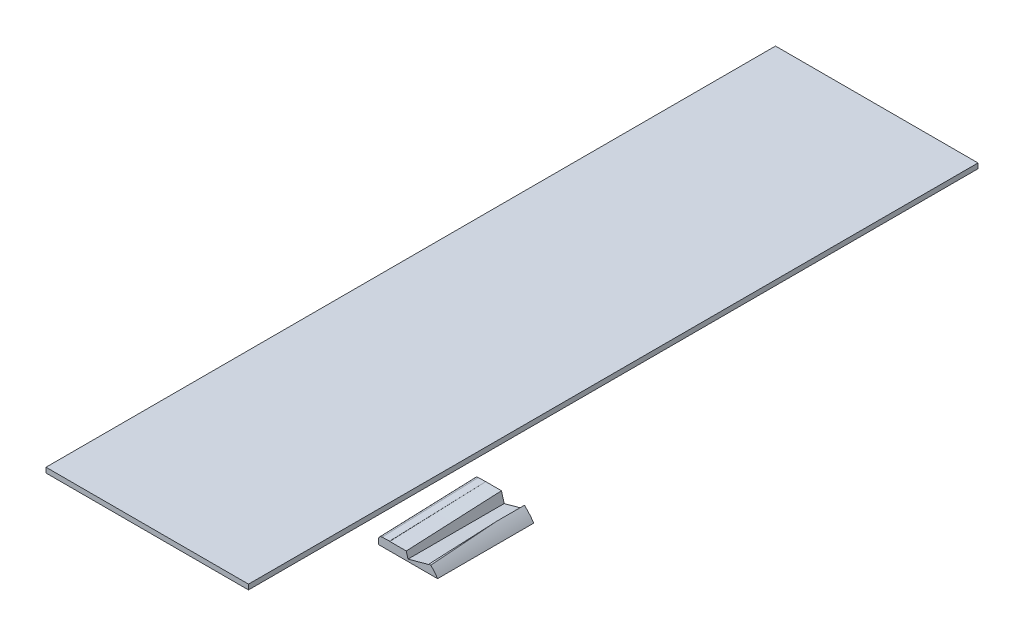
ISO-10303-21;
HEADER;
FILE_DESCRIPTION(('STEP AP214'),'2;1');
FILE_NAME('part.step','',(''),(''),'','','');
FILE_SCHEMA(('AUTOMOTIVE_DESIGN { 1 0 10303 214 1 1 1 1 }'));
ENDSEC;
DATA;
#1=APPLICATION_CONTEXT('core data for automotive mechanical design processes');
#2=APPLICATION_PROTOCOL_DEFINITION('international standard','automotive_design',2000,#1);
#3=PRODUCT_CONTEXT('',#1,'mechanical');
#4=PRODUCT('Part','Part','',(#3));
#5=PRODUCT_RELATED_PRODUCT_CATEGORY('part','',(#4));
#6=PRODUCT_DEFINITION_FORMATION('','',#4);
#7=PRODUCT_DEFINITION_CONTEXT('part definition',#1,'design');
#8=PRODUCT_DEFINITION('design','',#6,#7);
#9=PRODUCT_DEFINITION_SHAPE('','',#8);
#10=(LENGTH_UNIT() NAMED_UNIT(*) SI_UNIT(.MILLI.,.METRE.));
#11=(NAMED_UNIT(*) PLANE_ANGLE_UNIT() SI_UNIT($,.RADIAN.));
#12=(NAMED_UNIT(*) SI_UNIT($,.STERADIAN.) SOLID_ANGLE_UNIT());
#13=UNCERTAINTY_MEASURE_WITH_UNIT(LENGTH_MEASURE(1.E-05),#10,'distance_accuracy_value','');
#14=(GEOMETRIC_REPRESENTATION_CONTEXT(3) GLOBAL_UNCERTAINTY_ASSIGNED_CONTEXT((#13)) GLOBAL_UNIT_ASSIGNED_CONTEXT((#10,
#11,#12)) REPRESENTATION_CONTEXT('',''));
#15=CARTESIAN_POINT('',(0.,0.,0.));
#16=DIRECTION('',(0.,0.,1.));
#17=DIRECTION('',(1.,0.,0.));
#18=AXIS2_PLACEMENT_3D('',#15,#16,#17);
#19=CARTESIAN_POINT('',(38.8064860248671,394.0012038353,482.120102696812));
#20=DIRECTION('',(0.964308162620724,0.2647824909299,0.));
#21=DIRECTION('',(-0.2647824909299,0.964308162620724,0.));
#22=AXIS2_PLACEMENT_3D('',#19,#20,#21);
#23=PLANE('',#22);
#24=DIRECTION('',(0.,0.,1.));
#25=VECTOR('',#24,1.);
#26=CARTESIAN_POINT('',(116.345470624094,111.612910305147,-50.4145633031884));
#27=LINE('',#26,#25);
#28=CARTESIAN_POINT('',(116.345470624094,111.612910305147,124.093212790419));
#29=VERTEX_POINT('',#28);
#30=CARTESIAN_POINT('',(116.345470624094,111.612910305147,314.093212790419));
#31=VERTEX_POINT('',#30);
#32=EDGE_CURVE('E566',#29,#31,#27,.T.);
#33=ORIENTED_EDGE('',*,*,#32,.F.);
#34=DIRECTION('',(-0.2647824909299,0.964308162620724,0.));
#35=VECTOR('',#34,1.);
#36=CARTESIAN_POINT('',(38.8064860248671,394.0012038353,124.093212790419));
#37=LINE('',#36,#35);
#38=CARTESIAN_POINT('',(111.032147749001,130.96343684902,124.093212790419));
#39=VERTEX_POINT('',#38);
#40=EDGE_CURVE('E489',#29,#39,#37,.T.);
#41=ORIENTED_EDGE('',*,*,#40,.T.);
#42=CARTESIAN_POINT('',(109.753405284803,135.620473618277,-5.23468981717832));
#43=CARTESIAN_POINT('',(109.859389161119,135.234492216415,6.36334958936649));
#44=CARTESIAN_POINT('',(109.968473912636,134.837217774529,17.960976204007));
#45=CARTESIAN_POINT('',(110.191608713052,134.024585834063,41.1555083415589));
#46=CARTESIAN_POINT('',(110.305658744404,133.609228399388,52.7524138668736));
#47=CARTESIAN_POINT('',(110.5374882961,132.764931149021,75.9456780913623));
#48=CARTESIAN_POINT('',(110.655267812523,132.33599134761,87.5420367910984));
#49=CARTESIAN_POINT('',(110.893324143082,131.469016866347,110.734387183022));
#50=CARTESIAN_POINT('',(111.013600957132,131.030982186808,122.330378875221));
#51=CARTESIAN_POINT('',(111.255420185839,130.150303652129,145.522173363155));
#52=CARTESIAN_POINT('',(111.376962600501,129.707659796972,157.11797615889));
#53=CARTESIAN_POINT('',(111.620080541348,128.822251498203,180.309571512638));
#54=CARTESIAN_POINT('',(111.741656067517,128.379487054646,191.905364070655));
#55=CARTESIAN_POINT('',(111.983605853896,127.498333043556,215.097182801119));
#56=CARTESIAN_POINT('',(112.103980108491,127.059943496468,226.693208974403));
#57=CARTESIAN_POINT('',(112.342287225985,126.19205567729,249.885598553668));
#58=CARTESIAN_POINT('',(112.460220093464,125.762557388518,261.481961958975));
#59=CARTESIAN_POINT('',(112.692399143381,124.916987304792,284.675195414121));
#60=CARTESIAN_POINT('',(112.806645332728,124.500915484678,296.27206546297));
#61=CARTESIAN_POINT('',(113.030197847382,123.686762275762,319.466482028005));
#62=CARTESIAN_POINT('',(113.139504174712,123.288680879593,331.064028543912));
#63=CARTESIAN_POINT('',(113.351915343806,122.515103202801,354.259971588434));
#64=CARTESIAN_POINT('',(113.455020166764,122.139606990664,365.858368119519));
#65=CARTESIAN_POINT('',(113.653752060195,121.415847703049,389.056177246248));
#66=CARTESIAN_POINT('',(113.749379063485,121.067584872239,400.655589850082));
#67=CARTESIAN_POINT('',(113.840628259898,120.735265523539,412.255506908933));
#68=B_SPLINE_CURVE_WITH_KNOTS('',3,(#42,#43,#44,#45,#46,#47,#48,#49,#50,#51,#52,#53,#54,#55,#56,
#57,#58,#59,#60,#61,#62,#63,#64,#65,#66,#67),.UNSPECIFIED.,.F.,.F.,(4,2,2,2,2,2,2,2,2,2,2,2,4),
(0.,34.8148147103214,69.6295063951828,104.44416147604,139.25881536091,174.073469365323,
208.888107520512,243.702908296918,278.517643749172,313.332313958682,348.146969911807,
382.96173142915,417.776805691255),.UNSPECIFIED.);
#69=CARTESIAN_POINT('',(112.978168125339,123.876248693421,314.093212790419));
#70=VERTEX_POINT('',#69);
#71=EDGE_CURVE('E586',#39,#70,#68,.T.);
#72=ORIENTED_EDGE('',*,*,#71,.T.);
#73=DIRECTION('',(0.2647824909299,-0.964308162620724,0.));
#74=VECTOR('',#73,1.);
#75=CARTESIAN_POINT('',(38.8064860248671,394.0012038353,314.093212790419));
#76=LINE('',#75,#74);
#77=EDGE_CURVE('E554',#70,#31,#76,.T.);
#78=ORIENTED_EDGE('',*,*,#77,.T.);
#79=EDGE_LOOP('',(#33,#41,#72,#78));
#80=FACE_BOUND('',#79,.T.);
#81=ADVANCED_FACE('F341',(#80),#23,.T.);
#82=CARTESIAN_POINT('',(60.399869582043,50.092896258677,-548.050105014357));
#83=DIRECTION('',(0.999405965304478,0.0344632632497941,0.));
#84=DIRECTION('',(-0.0344632632497941,0.999405965304478,0.));
#85=AXIS2_PLACEMENT_3D('',#82,#83,#84);
#86=PLANE('',#85);
#87=DIRECTION('',(-0.0344632632497941,0.999405965304478,0.));
#88=VECTOR('',#87,1.);
#89=CARTESIAN_POINT('',(60.3998695820434,50.092896258677,124.093212790419));
#90=LINE('',#89,#88);
#91=CARTESIAN_POINT('',(58.4241385961295,107.387451299709,124.093212790419));
#92=VERTEX_POINT('',#91);
#93=CARTESIAN_POINT('',(57.8925702321294,122.802491660183,124.093212790419));
#94=VERTEX_POINT('',#93);
#95=EDGE_CURVE('E503',#92,#94,#90,.T.);
#96=ORIENTED_EDGE('',*,*,#95,.F.);
#97=DIRECTION('',(0.,0.,-1.));
#98=VECTOR('',#97,1.);
#99=CARTESIAN_POINT('',(58.4241385961295,107.387451299709,-548.050105014357));
#100=LINE('',#99,#98);
#101=CARTESIAN_POINT('',(58.42413859613,107.387451299709,314.093212790419));
#102=VERTEX_POINT('',#101);
#103=EDGE_CURVE('E562',#102,#92,#100,.T.);
#104=ORIENTED_EDGE('',*,*,#103,.F.);
#105=DIRECTION('',(0.0344632632497941,-0.999405965304478,0.));
#106=VECTOR('',#105,1.);
#107=CARTESIAN_POINT('',(60.3998695820435,50.092896258677,314.093212790419));
#108=LINE('',#107,#106);
#109=CARTESIAN_POINT('',(58.126172303513,116.028225916512,314.093212790419));
#110=VERTEX_POINT('',#109);
#111=EDGE_CURVE('E523',#110,#102,#108,.T.);
#112=ORIENTED_EDGE('',*,*,#111,.F.);
#113=DIRECTION('',(-0.00122870293653162,0.0356313630388315,-0.999364246036994));
#114=VECTOR('',#113,1.);
#115=CARTESIAN_POINT('',(57.0704178479695,146.644226877269,-544.603567444162));
#116=LINE('',#115,#114);
#117=EDGE_CURVE('E649',#110,#94,#116,.T.);
#118=ORIENTED_EDGE('',*,*,#117,.T.);
#119=EDGE_LOOP('',(#96,#104,#112,#118));
#120=FACE_BOUND('',#119,.T.);
#121=ADVANCED_FACE('F609',(#120),#86,.F.);
#122=CARTESIAN_POINT('',(155.443997278197,129.814876418465,1178.1644683725));
#123=CARTESIAN_POINT('',(196.657509568503,92.1237405424365,1178.1644683725));
#124=CARTESIAN_POINT('',(192.258596174472,34.9150214858441,1178.1644683725));
#125=B_SPLINE_CURVE_WITH_KNOTS('',2,(#122,#123,#124),.UNSPECIFIED.,.F.,.F.,(3,3),(0.,1.),.UNSPECIFIED.);
#126=DIRECTION('',(0.,0.,-1.));
#127=VECTOR('',#126,1.);
#128=SURFACE_OF_LINEAR_EXTRUSION('',#125,#127);
#129=DIRECTION('',(0.,0.,-1.));
#130=VECTOR('',#129,1.);
#131=CARTESIAN_POINT('',(174.808942224235,107.387451299709,29.6657032982748));
#132=LINE('',#131,#130);
#133=CARTESIAN_POINT('',(174.808942224235,107.387451299709,314.093212790419));
#134=VERTEX_POINT('',#133);
#135=CARTESIAN_POINT('',(174.808942224187,107.387451299782,124.093212790419));
#136=VERTEX_POINT('',#135);
#137=EDGE_CURVE('E558',#134,#136,#132,.T.);
#138=ORIENTED_EDGE('',*,*,#137,.T.);
#139=CARTESIAN_POINT('',(155.443997278197,129.814876418465,124.093212790419));
#140=CARTESIAN_POINT('',(196.657509568503,92.1237405424365,124.093212790419));
#141=CARTESIAN_POINT('',(192.258596174472,34.9150214858441,124.093212790419));
#142=B_SPLINE_CURVE_WITH_KNOTS('',2,(#139,#140,#141),.UNSPECIFIED.,.F.,.F.,(3,3),(0.,1.),.UNSPECIFIED.);
#143=CARTESIAN_POINT('',(156.447540783786,128.887901600093,124.093212790419));
#144=VERTEX_POINT('',#143);
#145=EDGE_CURVE('E478',#136,#144,#142,.F.);
#146=ORIENTED_EDGE('',*,*,#145,.T.);
#147=DIRECTION('',(0.,0.,-1.));
#148=VECTOR('',#147,1.);
#149=CARTESIAN_POINT('',(156.447540783786,128.887901600093,-18.0163537751292));
#150=LINE('',#149,#148);
#151=CARTESIAN_POINT('',(156.447540783786,128.887901600093,178.590960311125));
#152=VERTEX_POINT('',#151);
#153=EDGE_CURVE('E573',#152,#144,#150,.T.);
#154=ORIENTED_EDGE('',*,*,#153,.F.);
#155=CARTESIAN_POINT('',(155.443997278197,129.814876418465,154.304641544295));
#156=CARTESIAN_POINT('',(155.734051505039,129.549623457936,161.259292806022));
#157=CARTESIAN_POINT('',(156.021988011791,129.284010415257,168.214019417162));
#158=CARTESIAN_POINT('',(156.59269964531,128.753030793238,182.123756509917));
#159=CARTESIAN_POINT('',(156.875474725584,128.487664216138,189.078766993523));
#160=CARTESIAN_POINT('',(157.434933951778,127.958147410217,202.989120596551));
#161=CARTESIAN_POINT('',(157.711618061939,127.693997188544,209.944463717684));
#162=CARTESIAN_POINT('',(158.25804739624,127.167885610418,223.855527595067));
#163=CARTESIAN_POINT('',(158.527792598551,126.905924260852,230.811248352436));
#164=CARTESIAN_POINT('',(159.059551053491,126.385165470734,244.723110578769));
#165=CARTESIAN_POINT('',(159.321564299139,126.126368033039,251.679252048106));
#166=CARTESIAN_POINT('',(159.837110889075,125.612926831778,265.591683353048));
#167=CARTESIAN_POINT('',(160.090644621403,125.358282878412,272.547973167247));
#168=CARTESIAN_POINT('',(160.588558778533,124.854118410673,286.461052616785));
#169=CARTESIAN_POINT('',(160.832939221612,124.60459788607,293.4178422511));
#170=CARTESIAN_POINT('',(161.311907108731,124.111666020756,307.331958851467));
#171=CARTESIAN_POINT('',(161.546494576416,123.868254665295,314.289285816182));
#172=CARTESIAN_POINT('',(162.005277674072,123.388531463606,328.204513043689));
#173=CARTESIAN_POINT('',(162.22947332564,123.152219602625,335.162413305261));
#174=CARTESIAN_POINT('',(162.666909271652,122.687690665785,349.078823323551));
#175=CARTESIAN_POINT('',(162.880149576335,122.459473582361,356.037333079693));
#176=CARTESIAN_POINT('',(163.169236024952,122.147854542386,365.732475480746));
#177=CARTESIAN_POINT('',(163.249938380707,122.060607711622,368.468840656657));
#178=CARTESIAN_POINT('',(163.409535563909,121.887581649103,373.94167084557));
#179=CARTESIAN_POINT('',(163.488430390951,121.801802417678,376.678135858593));
#180=CARTESIAN_POINT('',(163.644381506529,121.631772846951,382.151165952317));
#181=CARTESIAN_POINT('',(163.721437794938,121.547522507754,384.887731033025));
#182=CARTESIAN_POINT('',(163.873682191636,121.380611291794,390.360990828656));
#183=CARTESIAN_POINT('',(163.948870280034,121.297950431956,393.097685544651));
#184=CARTESIAN_POINT('',(164.097347326598,121.134280700438,398.571175735893));
#185=CARTESIAN_POINT('',(164.170636284889,121.053271828649,401.307971211135));
#186=CARTESIAN_POINT('',(164.315285393814,120.892967879279,406.781663200088));
#187=CARTESIAN_POINT('',(164.386645544527,120.813672801629,409.518559713794));
#188=CARTESIAN_POINT('',(164.457026453189,120.735265523539,412.255506908933));
#189=B_SPLINE_CURVE_WITH_KNOTS('',3,(#155,#156,#157,#158,#159,#160,#161,#162,#163,#164,#165,
#166,#167,#168,#169,#170,#171,#172,#173,#174,#175,#176,#177,#178,#179,#180,#181,#182,#183,#184,
#185,#186,#187,#188),.UNSPECIFIED.,.F.,.F.,(4,2,2,2,2,2,2,2,2,2,2,2,2,2,2,2,4),(0.,
20.8972490513841,41.7946862483872,62.6922460981629,83.5898716807254,104.487516130297,
125.384202946792,146.280848033584,167.17744266649,188.073993868766,208.970525538964,
217.187359546027,225.404195398942,233.621031815379,241.837955678119,250.054878996919,
258.271801975937),.UNSPECIFIED.);
#190=CARTESIAN_POINT('',(161.538208059443,123.87624869342,314.093212790419));
#191=VERTEX_POINT('',#190);
#192=EDGE_CURVE('E634',#152,#191,#189,.T.);
#193=ORIENTED_EDGE('',*,*,#192,.T.);
#194=CARTESIAN_POINT('',(155.443997278197,129.814876418465,314.093212790419));
#195=CARTESIAN_POINT('',(196.657509568503,92.1237405424365,314.093212790419));
#196=CARTESIAN_POINT('',(192.258596174472,34.9150214858441,314.093212790419));
#197=B_SPLINE_CURVE_WITH_KNOTS('',2,(#194,#195,#196),.UNSPECIFIED.,.F.,.F.,(3,3),(0.,1.),.UNSPECIFIED.);
#198=EDGE_CURVE('E517',#191,#134,#197,.T.);
#199=ORIENTED_EDGE('',*,*,#198,.T.);
#200=EDGE_LOOP('',(#138,#146,#154,#193,#199));
#201=FACE_BOUND('',#200,.T.);
#202=ADVANCED_FACE('F613',(#201),#128,.T.);
#203=CARTESIAN_POINT('',(0.,107.387451299709,0.));
#204=DIRECTION('',(0.,-1.,0.));
#205=DIRECTION('',(0.,0.,-1.));
#206=AXIS2_PLACEMENT_3D('',#203,#204,#205);
#207=PLANE('',#206);
#208=ORIENTED_EDGE('',*,*,#103,.T.);
#209=DIRECTION('',(1.,0.,0.));
#210=VECTOR('',#209,1.);
#211=CARTESIAN_POINT('',(0.,107.387451299709,124.093212790419));
#212=LINE('',#211,#210);
#213=CARTESIAN_POINT('',(83.7281431725654,107.387451299709,124.093212790419));
#214=VERTEX_POINT('',#213);
#215=EDGE_CURVE('E499',#92,#214,#212,.T.);
#216=ORIENTED_EDGE('',*,*,#215,.T.);
#217=DIRECTION('',(0.,0.,1.));
#218=VECTOR('',#217,1.);
#219=CARTESIAN_POINT('',(83.7281431725654,107.387451299709,119.093212790419));
#220=LINE('',#219,#218);
#221=CARTESIAN_POINT('',(83.7281431725654,107.387451299709,119.093212790419));
#222=VERTEX_POINT('',#221);
#223=EDGE_CURVE('E850',#222,#214,#220,.T.);
#224=ORIENTED_EDGE('',*,*,#223,.F.);
#225=DIRECTION('',(-1.,0.,0.));
#226=VECTOR('',#225,1.);
#227=CARTESIAN_POINT('',(85.7281431725654,107.387451299709,119.093212790419));
#228=LINE('',#227,#226);
#229=CARTESIAN_POINT('',(85.7281431725654,107.387451299709,119.093212790419));
#230=VERTEX_POINT('',#229);
#231=EDGE_CURVE('E464',#230,#222,#228,.T.);
#232=ORIENTED_EDGE('',*,*,#231,.F.);
#233=DIRECTION('',(0.,0.,1.));
#234=VECTOR('',#233,1.);
#235=CARTESIAN_POINT('',(85.7281431725654,107.387451299709,119.093212790419));
#236=LINE('',#235,#234);
#237=CARTESIAN_POINT('',(85.7281431725654,107.387451299709,124.093212790419));
#238=VERTEX_POINT('',#237);
#239=EDGE_CURVE('E480',#230,#238,#236,.T.);
#240=ORIENTED_EDGE('',*,*,#239,.T.);
#241=EDGE_CURVE('E363',#238,#136,#212,.T.);
#242=ORIENTED_EDGE('',*,*,#241,.T.);
#243=ORIENTED_EDGE('',*,*,#137,.F.);
#244=DIRECTION('',(-1.,0.,0.));
#245=VECTOR('',#244,1.);
#246=CARTESIAN_POINT('',(0.,107.387451299709,314.093212790419));
#247=LINE('',#246,#245);
#248=EDGE_CURVE('E350',#134,#102,#247,.T.);
#249=ORIENTED_EDGE('',*,*,#248,.T.);
#250=EDGE_LOOP('',(#208,#216,#224,#232,#240,#242,#243,#249));
#251=FACE_BOUND('',#250,.T.);
#252=ADVANCED_FACE('F602',(#251),#207,.T.);
#253=CARTESIAN_POINT('',(162.161570526622,108.078045543812,482.120102696812));
#254=DIRECTION('',(0.964308162620724,0.2647824909299,0.));
#255=DIRECTION('',(-0.2647824909299,0.964308162620724,0.));
#256=AXIS2_PLACEMENT_3D('',#253,#254,#255);
#257=PLANE('',#256);
#258=DIRECTION('',(-0.2647824909299,0.964308162620724,0.));
#259=VECTOR('',#258,1.);
#260=CARTESIAN_POINT('',(162.161570526622,108.078045543812,124.093212790419));
#261=LINE('',#260,#259);
#262=CARTESIAN_POINT('',(158.046850617572,123.063394390939,124.093212790419));
#263=VERTEX_POINT('',#262);
#264=EDGE_CURVE('E474',#263,#144,#261,.T.);
#265=ORIENTED_EDGE('',*,*,#264,.F.);
#266=DIRECTION('',(0.,0.,-1.));
#267=VECTOR('',#266,1.);
#268=CARTESIAN_POINT('',(158.046850617572,123.063394390938,-50.4145633031884));
#269=LINE('',#268,#267);
#270=CARTESIAN_POINT('',(158.046850617572,123.063394390938,314.093212790419));
#271=VERTEX_POINT('',#270);
#272=EDGE_CURVE('E569',#271,#263,#269,.T.);
#273=ORIENTED_EDGE('',*,*,#272,.F.);
#274=DIRECTION('',(0.2647824909299,-0.964308162620724,0.));
#275=VECTOR('',#274,1.);
#276=CARTESIAN_POINT('',(162.161570526622,108.078045543812,314.093212790419));
#277=LINE('',#276,#275);
#278=CARTESIAN_POINT('',(157.823654760358,123.876248693421,314.093212790419));
#279=VERTEX_POINT('',#278);
#280=EDGE_CURVE('E547',#279,#271,#277,.T.);
#281=ORIENTED_EDGE('',*,*,#280,.F.);
#282=CARTESIAN_POINT('',(155.542008253375,132.185749609331,91.5430926720661));
#283=CARTESIAN_POINT('',(155.633003973171,131.854353394063,100.451307548287));
#284=CARTESIAN_POINT('',(155.724815916478,131.51998458423,109.35940236194));
#285=CARTESIAN_POINT('',(155.909513677692,130.847336033599,127.175418394114));
#286=CARTESIAN_POINT('',(156.002399493798,130.509056299362,136.0833396129));
#287=CARTESIAN_POINT('',(156.188686590482,129.830619567037,153.899090837813));
#288=CARTESIAN_POINT('',(156.282087870248,129.490462571907,162.80692084406));
#289=CARTESIAN_POINT('',(156.468846997029,128.810306758863,180.62257287191));
#290=CARTESIAN_POINT('',(156.562204844113,128.470307940692,189.530394893502));
#291=CARTESIAN_POINT('',(156.74831727587,127.79250731846,207.346114112854));
#292=CARTESIAN_POINT('',(156.841071861549,127.454705510734,216.254011310464));
#293=CARTESIAN_POINT('',(157.025416554565,126.783342794916,234.069964304733));
#294=CARTESIAN_POINT('',(157.11700666368,126.449781880355,242.978020101129));
#295=CARTESIAN_POINT('',(157.2984599085,125.788949494876,260.794428963228));
#296=CARTESIAN_POINT('',(157.388323035323,125.461678056309,269.702782030225));
#297=CARTESIAN_POINT('',(157.565756269026,124.815486100871,287.519805166866));
#298=CARTESIAN_POINT('',(157.653326378319,124.496565575211,296.428475236166));
#299=CARTESIAN_POINT('',(157.825605380632,123.869144752952,314.246207407023));
#300=CARTESIAN_POINT('',(157.910314274768,123.560644452293,323.155269508426));
#301=CARTESIAN_POINT('',(158.076299341171,122.95614543937,340.973860967412));
#302=CARTESIAN_POINT('',(158.15757550949,122.660146741491,349.883390325522));
#303=CARTESIAN_POINT('',(158.316120262023,122.082744517985,367.702992895625));
#304=CARTESIAN_POINT('',(158.3933888312,121.801341047122,376.613066109533));
#305=CARTESIAN_POINT('',(158.543338097689,121.255242620649,394.433830260586));
#306=CARTESIAN_POINT('',(158.616018760114,120.990547792095,403.344521201912));
#307=CARTESIAN_POINT('',(158.686114894917,120.735265523539,412.255506908933));
#308=B_SPLINE_CURVE_WITH_KNOTS('',3,(#282,#283,#284,#285,#286,#287,#288,#289,#290,#291,#292,
#293,#294,#295,#296,#297,#298,#299,#300,#301,#302,#303,#304,#305,#306,#307),.UNSPECIFIED.,.F.,
.F.,(4,2,2,2,2,2,2,2,2,2,2,2,4),(0.,26.7445218848045,53.4889989109093,80.2334338125381,
106.977825169902,133.722171912836,160.466477850084,187.210921308928,213.955336619571,
240.699741510546,267.444177173242,294.188713177127,320.933452525839),.UNSPECIFIED.);
#309=EDGE_CURVE('E577',#152,#279,#308,.T.);
#310=ORIENTED_EDGE('',*,*,#309,.F.);
#311=ORIENTED_EDGE('',*,*,#153,.T.);
#312=EDGE_LOOP('',(#265,#273,#281,#310,#311));
#313=FACE_BOUND('',#312,.T.);
#314=ADVANCED_FACE('F597',(#313),#257,.F.);
#315=CARTESIAN_POINT('',(-321.200733720247,120.735265523539,412.255506908933));
#316=CARTESIAN_POINT('',(-321.200733720247,126.459976930153,212.424074831064));
#317=CARTESIAN_POINT('',(-321.200733720247,140.766819561367,-62.0318859574016));
#318=CARTESIAN_POINT('',(-321.200733720247,142.224095205381,-367.378936481385));
#319=CARTESIAN_POINT('',(-321.200733720247,150.388874092584,-474.702692901168));
#320=CARTESIAN_POINT('',(-321.200733720247,167.203516207955,-505.045548771997));
#321=B_SPLINE_CURVE_WITH_KNOTS('',3,(#315,#316,#317,#318,#319,#320),.UNSPECIFIED.,.F.,.F.,(4,1,
1,4),(0.,0.65432029386997,0.889445498951443,1.),.UNSPECIFIED.);
#322=DIRECTION('',(1.,0.,0.));
#323=VECTOR('',#322,1.);
#324=SURFACE_OF_LINEAR_EXTRUSION('',#321,#323);
#325=DIRECTION('',(1.,0.,0.));
#326=VECTOR('',#325,1.);
#327=CARTESIAN_POINT('',(96.377446909269,130.96343684902,124.093212790419));
#328=LINE('',#327,#326);
#329=CARTESIAN_POINT('',(79.9373177746105,130.96343684902,124.093212790419));
#330=VERTEX_POINT('',#329);
#331=EDGE_CURVE('E496',#330,#39,#328,.T.);
#332=ORIENTED_EDGE('',*,*,#331,.F.);
#333=CARTESIAN_POINT('',(80.2900234549761,120.735265523539,412.255506908933));
#334=CARTESIAN_POINT('',(80.278564041773,121.067578973693,400.655794392538));
#335=CARTESIAN_POINT('',(80.2665548199383,121.415836416795,389.056551535654));
#336=CARTESIAN_POINT('',(80.2415972040777,122.13958651527,365.859011844279));
#337=CARTESIAN_POINT('',(80.2286488179084,122.515078942813,354.260715002685));
#338=CARTESIAN_POINT('',(80.2019731590427,123.288650859249,331.064912745115));
#339=CARTESIAN_POINT('',(80.1882458885456,123.686730284366,319.467407326995));
#340=CARTESIAN_POINT('',(80.1601709113265,124.500881268998,296.273026338555));
#341=CARTESIAN_POINT('',(80.1458232043681,124.916952835373,284.676150768476));
#342=CARTESIAN_POINT('',(80.1166647459532,125.76252387337,261.482871361706));
#343=CARTESIAN_POINT('',(80.1018539936888,126.192023368423,249.886467525874));
#344=CARTESIAN_POINT('',(80.0719258491185,127.059914664648,226.69397385276));
#345=CARTESIAN_POINT('',(80.0568084562769,127.498306481357,215.097884016062));
#346=CARTESIAN_POINT('',(80.0264227812028,128.379465781585,191.905921871479));
#347=CARTESIAN_POINT('',(80.011154499627,128.822233246065,180.310049562866));
#348=CARTESIAN_POINT('',(79.9806220940239,129.707647609577,157.118295414693));
#349=CARTESIAN_POINT('',(79.9653579699983,130.150294508559,145.522413575131));
#350=CARTESIAN_POINT('',(79.9349886820465,131.030978595875,122.330474013774));
#351=CARTESIAN_POINT('',(79.9198835181197,131.469015784225,110.734416291979));
#352=CARTESIAN_POINT('',(79.8899868515431,132.33599424482,87.5419591268399));
#353=CARTESIAN_POINT('',(79.8751953489032,132.764935516774,75.9455596834848));
#354=CARTESIAN_POINT('',(79.846080764425,133.609234247106,52.7522516502531));
#355=CARTESIAN_POINT('',(79.8317576830452,134.024591692184,41.155343059889));
#356=CARTESIAN_POINT('',(79.8037351454436,134.837221971533,17.9608544875777));
#357=CARTESIAN_POINT('',(79.790035691274,135.234494746294,6.3632745035468));
#358=CARTESIAN_POINT('',(79.7767256931993,135.620473618277,-5.23468981717825));
#359=B_SPLINE_CURVE_WITH_KNOTS('',3,(#333,#334,#335,#336,#337,#338,#339,#340,#341,#342,#343,
#344,#345,#346,#347,#348,#349,#350,#351,#352,#353,#354,#355,#356,#357,#358),.UNSPECIFIED.,.F.,
.F.,(4,2,2,2,2,2,2,2,2,2,2,2,4),(0.,34.8134032424337,69.626515291114,104.439529045767,
139.252556073134,174.065643849868,208.878792453331,243.691789635283,278.504801575262,
313.317813403808,348.13082634597,382.943873371801,417.757034950176),.UNSPECIFIED.);
#360=CARTESIAN_POINT('',(80.1817105835288,123.876248693421,314.093212790419));
#361=VERTEX_POINT('',#360);
#362=EDGE_CURVE('E627',#361,#330,#359,.T.);
#363=ORIENTED_EDGE('',*,*,#362,.F.);
#364=DIRECTION('',(1.,0.,0.));
#365=VECTOR('',#364,1.);
#366=CARTESIAN_POINT('',(96.8086769765485,123.876248693421,314.093212790419));
#367=LINE('',#366,#365);
#368=EDGE_CURVE('E541',#70,#361,#367,.F.);
#369=ORIENTED_EDGE('',*,*,#368,.F.);
#370=ORIENTED_EDGE('',*,*,#71,.F.);
#371=EDGE_LOOP('',(#332,#363,#369,#370));
#372=FACE_BOUND('',#371,.T.);
#373=ADVANCED_FACE('F601',(#372),#324,.F.);
#374=CARTESIAN_POINT('',(82.6995199423151,50.8618717775596,-548.050105014357));
#375=DIRECTION('',(0.999405965304478,0.0344632632497941,0.));
#376=DIRECTION('',(-0.0344632632497941,0.999405965304478,0.));
#377=AXIS2_PLACEMENT_3D('',#374,#375,#376);
#378=PLANE('',#377);
#379=ORIENTED_EDGE('',*,*,#362,.T.);
#380=DIRECTION('',(-0.0344632632497941,0.999405965304478,0.));
#381=VECTOR('',#380,1.);
#382=CARTESIAN_POINT('',(82.6995199423155,50.8618717775596,124.093212790419));
#383=LINE('',#382,#381);
#384=CARTESIAN_POINT('',(79.9357323560279,131.009412669145,124.093212790419));
#385=VERTEX_POINT('',#384);
#386=EDGE_CURVE('E513',#330,#385,#383,.T.);
#387=ORIENTED_EDGE('',*,*,#386,.T.);
#388=DIRECTION('',(-0.00122870293653165,0.0356313630388315,-0.999364246036994));
#389=VECTOR('',#388,1.);
#390=CARTESIAN_POINT('',(80.2900234549792,120.735265523542,412.255506908934));
#391=LINE('',#390,#389);
#392=CARTESIAN_POINT('',(80.1693344274116,124.235146925474,314.093212790419));
#393=VERTEX_POINT('',#392);
#394=EDGE_CURVE('E635',#393,#385,#391,.T.);
#395=ORIENTED_EDGE('',*,*,#394,.F.);
#396=DIRECTION('',(0.0344632632497941,-0.999405965304478,0.));
#397=VECTOR('',#396,1.);
#398=CARTESIAN_POINT('',(82.6995199423157,50.8618717775596,314.093212790419));
#399=LINE('',#398,#397);
#400=EDGE_CURVE('E537',#393,#361,#399,.T.);
#401=ORIENTED_EDGE('',*,*,#400,.T.);
#402=EDGE_LOOP('',(#379,#387,#395,#401));
#403=FACE_BOUND('',#402,.T.);
#404=ADVANCED_FACE('F615',(#403),#378,.T.);
#405=CARTESIAN_POINT('',(57.9903730947071,119.966290004659,412.255506908934));
#406=DIRECTION('',(0.0344413530936049,-0.998770589001383,-0.0356525418856952));
#407=DIRECTION('',(0.,0.0356737063605036,-0.999363490765249));
#408=AXIS2_PLACEMENT_3D('',#405,#406,#407);
#409=PLANE('',#408);
#410=DIRECTION('',(0.999405965304478,0.0344632632497941,0.));
#411=VECTOR('',#410,1.);
#412=CARTESIAN_POINT('',(57.636081995756,130.240437150263,124.093212790419));
#413=LINE('',#412,#411);
#414=CARTESIAN_POINT('',(65.0692987825131,130.496762323224,124.093212790419));
#415=VERTEX_POINT('',#414);
#416=EDGE_CURVE('E510',#415,#385,#413,.T.);
#417=ORIENTED_EDGE('',*,*,#416,.F.);
#418=DIRECTION('',(-0.00122870293653162,0.0356313630388315,-0.999364246036994));
#419=VECTOR('',#418,1.);
#420=CARTESIAN_POINT('',(65.4235898814645,120.22261517762,412.255506908934));
#421=LINE('',#420,#419);
#422=CARTESIAN_POINT('',(65.3029008538968,123.722496579553,314.093212790419));
#423=VERTEX_POINT('',#422);
#424=EDGE_CURVE('E660',#415,#423,#421,.F.);
#425=ORIENTED_EDGE('',*,*,#424,.T.);
#426=DIRECTION('',(-0.999405965304478,-0.0344632632497941,0.));
#427=VECTOR('',#426,1.);
#428=CARTESIAN_POINT('',(57.8696840671395,123.466171406592,314.093212790419));
#429=LINE('',#428,#427);
#430=EDGE_CURVE('E533',#393,#423,#429,.T.);
#431=ORIENTED_EDGE('',*,*,#430,.F.);
#432=ORIENTED_EDGE('',*,*,#394,.T.);
#433=EDGE_LOOP('',(#417,#425,#431,#432));
#434=FACE_BOUND('',#433,.T.);
#435=ADVANCED_FACE('F618',(#434),#409,.F.);
#436=CARTESIAN_POINT('',(64.5036346347269,146.900552050229,-544.603567444162));
#437=DIRECTION('',(-0.00122870293653162,0.0356313630388315,-0.999364246036994));
#438=DIRECTION('',(0.,0.999365000413399,0.0356313899353906));
#439=AXIS2_PLACEMENT_3D('',#436,#437,#438);
#440=CYLINDRICAL_SURFACE('',#439,7.437635);
#441=ORIENTED_EDGE('',*,*,#424,.F.);
#442=CARTESIAN_POINT('',(65.3257870188868,123.058816833144,124.093212790419));
#443=DIRECTION('',(0.,0.,-1.));
#444=DIRECTION('',(-0.0344632632498107,0.999405965304477,0.));
#445=AXIS2_PLACEMENT_3D('',#442,#443,#444);
#446=ELLIPSE('',#445,7.44236651400542,7.437635);
#447=EDGE_CURVE('E506',#415,#94,#446,.F.);
#448=ORIENTED_EDGE('',*,*,#447,.T.);
#449=ORIENTED_EDGE('',*,*,#117,.F.);
#450=CARTESIAN_POINT('',(65.5593890902704,116.284551089473,314.093212790419));
#451=DIRECTION('',(0.,0.,1.));
#452=DIRECTION('',(-0.0344632632498107,0.999405965304477,0.));
#453=AXIS2_PLACEMENT_3D('',#450,#451,#452);
#454=ELLIPSE('',#453,7.44236651400542,7.437635);
#455=EDGE_CURVE('E529',#110,#423,#454,.F.);
#456=ORIENTED_EDGE('',*,*,#455,.T.);
#457=EDGE_LOOP('',(#441,#448,#449,#456));
#458=FACE_BOUND('',#457,.T.);
#459=ADVANCED_FACE('F343',(#458),#440,.T.);
#460=CARTESIAN_POINT('',(-20.3413844906981,74.0810430270476,0.));
#461=DIRECTION('',(-0.2647824909299,0.964308162620724,0.));
#462=DIRECTION('',(-0.964308162620724,-0.2647824909299,0.));
#463=AXIS2_PLACEMENT_3D('',#460,#461,#462);
#464=PLANE('',#463);
#465=ORIENTED_EDGE('',*,*,#272,.T.);
#466=DIRECTION('',(-0.964308162620724,-0.2647824909299,0.));
#467=VECTOR('',#466,1.);
#468=CARTESIAN_POINT('',(-20.3413844906981,74.0810430270476,124.093212790419));
#469=LINE('',#468,#467);
#470=EDGE_CURVE('E14',#263,#29,#469,.T.);
#471=ORIENTED_EDGE('',*,*,#470,.T.);
#472=ORIENTED_EDGE('',*,*,#32,.T.);
#473=DIRECTION('',(0.964308162620724,0.2647824909299,0.));
#474=VECTOR('',#473,1.);
#475=CARTESIAN_POINT('',(-20.3413844906981,74.0810430270476,314.093212790419));
#476=LINE('',#475,#474);
#477=EDGE_CURVE('E550',#31,#271,#476,.T.);
#478=ORIENTED_EDGE('',*,*,#477,.T.);
#479=EDGE_LOOP('',(#465,#471,#472,#478));
#480=FACE_BOUND('',#479,.T.);
#481=ADVANCED_FACE('F604',(#480),#464,.T.);
#482=DIRECTION('',(1.,0.,0.));
#483=VECTOR('',#482,1.);
#484=CARTESIAN_POINT('',(160.452283618488,123.876248693421,314.093212790419));
#485=LINE('',#484,#483);
#486=EDGE_CURVE('E544',#191,#279,#485,.F.);
#487=ORIENTED_EDGE('',*,*,#486,.F.);
#488=ORIENTED_EDGE('',*,*,#192,.F.);
#489=ORIENTED_EDGE('',*,*,#309,.T.);
#490=EDGE_LOOP('',(#487,#488,#489));
#491=FACE_BOUND('',#490,.T.);
#492=ADVANCED_FACE('F593',(#491),#324,.F.);
#493=CARTESIAN_POINT('',(0.,0.,314.093212790419));
#494=DIRECTION('',(0.,0.,1.));
#495=DIRECTION('',(1.,0.,0.));
#496=AXIS2_PLACEMENT_3D('',#493,#494,#495);
#497=PLANE('',#496);
#498=ORIENTED_EDGE('',*,*,#368,.T.);
#499=ORIENTED_EDGE('',*,*,#400,.F.);
#500=ORIENTED_EDGE('',*,*,#430,.T.);
#501=ORIENTED_EDGE('',*,*,#455,.F.);
#502=ORIENTED_EDGE('',*,*,#111,.T.);
#503=ORIENTED_EDGE('',*,*,#248,.F.);
#504=ORIENTED_EDGE('',*,*,#198,.F.);
#505=ORIENTED_EDGE('',*,*,#486,.T.);
#506=ORIENTED_EDGE('',*,*,#280,.T.);
#507=ORIENTED_EDGE('',*,*,#477,.F.);
#508=ORIENTED_EDGE('',*,*,#77,.F.);
#509=EDGE_LOOP('',(#498,#499,#500,#501,#502,#503,#504,#505,#506,#507,#508));
#510=FACE_BOUND('',#509,.T.);
#511=ADVANCED_FACE('F678',(#510),#497,.T.);
#512=CARTESIAN_POINT('',(0.,0.,124.093212790419));
#513=DIRECTION('',(0.,0.,-1.));
#514=DIRECTION('',(-1.,0.,0.));
#515=AXIS2_PLACEMENT_3D('',#512,#513,#514);
#516=PLANE('',#515);
#517=DIRECTION('',(0.,1.,0.));
#518=VECTOR('',#517,1.);
#519=CARTESIAN_POINT('',(83.7281431725654,107.387451299709,124.093212790419));
#520=LINE('',#519,#518);
#521=CARTESIAN_POINT('',(83.7281431725654,109.387451299709,124.093212790419));
#522=VERTEX_POINT('',#521);
#523=EDGE_CURVE('E472',#214,#522,#520,.T.);
#524=ORIENTED_EDGE('',*,*,#523,.F.);
#525=ORIENTED_EDGE('',*,*,#215,.F.);
#526=ORIENTED_EDGE('',*,*,#95,.T.);
#527=ORIENTED_EDGE('',*,*,#447,.F.);
#528=ORIENTED_EDGE('',*,*,#416,.T.);
#529=ORIENTED_EDGE('',*,*,#386,.F.);
#530=ORIENTED_EDGE('',*,*,#331,.T.);
#531=ORIENTED_EDGE('',*,*,#40,.F.);
#532=ORIENTED_EDGE('',*,*,#470,.F.);
#533=ORIENTED_EDGE('',*,*,#264,.T.);
#534=ORIENTED_EDGE('',*,*,#145,.F.);
#535=ORIENTED_EDGE('',*,*,#241,.F.);
#536=DIRECTION('',(0.,-1.,0.));
#537=VECTOR('',#536,1.);
#538=CARTESIAN_POINT('',(85.7281431725654,107.387451299709,124.093212790419));
#539=LINE('',#538,#537);
#540=CARTESIAN_POINT('',(85.7281431725654,109.387451299709,124.093212790419));
#541=VERTEX_POINT('',#540);
#542=EDGE_CURVE('E469',#541,#238,#539,.T.);
#543=ORIENTED_EDGE('',*,*,#542,.F.);
#544=DIRECTION('',(1.,0.,0.));
#545=VECTOR('',#544,1.);
#546=CARTESIAN_POINT('',(85.7281431725654,109.387451299709,124.093212790419));
#547=LINE('',#546,#545);
#548=EDGE_CURVE('E357',#522,#541,#547,.T.);
#549=ORIENTED_EDGE('',*,*,#548,.F.);
#550=EDGE_LOOP('',(#524,#525,#526,#527,#528,#529,#530,#531,#532,#533,#534,#535,#543,#549));
#551=FACE_BOUND('',#550,.T.);
#552=ADVANCED_FACE('F671',(#551),#516,.T.);
#553=CARTESIAN_POINT('',(83.7281431725654,107.387451299709,119.093212790419));
#554=DIRECTION('',(1.,0.,0.));
#555=DIRECTION('',(0.,0.,-1.));
#556=AXIS2_PLACEMENT_3D('',#553,#554,#555);
#557=PLANE('',#556);
#558=ORIENTED_EDGE('',*,*,#523,.T.);
#559=DIRECTION('',(0.,0.,1.));
#560=VECTOR('',#559,1.);
#561=CARTESIAN_POINT('',(83.7281431725654,109.387451299709,119.093212790419));
#562=LINE('',#561,#560);
#563=CARTESIAN_POINT('',(83.7281431725654,109.387451299709,119.093212790419));
#564=VERTEX_POINT('',#563);
#565=EDGE_CURVE('E451',#564,#522,#562,.T.);
#566=ORIENTED_EDGE('',*,*,#565,.F.);
#567=DIRECTION('',(0.,1.,0.));
#568=VECTOR('',#567,1.);
#569=CARTESIAN_POINT('',(83.7281431725654,107.387451299709,119.093212790419));
#570=LINE('',#569,#568);
#571=EDGE_CURVE('E459',#222,#564,#570,.T.);
#572=ORIENTED_EDGE('',*,*,#571,.F.);
#573=ORIENTED_EDGE('',*,*,#223,.T.);
#574=EDGE_LOOP('',(#558,#566,#572,#573));
#575=FACE_BOUND('',#574,.T.);
#576=ADVANCED_FACE('F471',(#575),#557,.F.);
#577=CARTESIAN_POINT('',(85.7281431725654,109.387451299709,119.093212790419));
#578=DIRECTION('',(0.,-1.,0.));
#579=DIRECTION('',(0.,0.,-1.));
#580=AXIS2_PLACEMENT_3D('',#577,#578,#579);
#581=PLANE('',#580);
#582=ORIENTED_EDGE('',*,*,#548,.T.);
#583=DIRECTION('',(0.,0.,1.));
#584=VECTOR('',#583,1.);
#585=CARTESIAN_POINT('',(85.7281431725654,109.387451299709,119.093212790419));
#586=LINE('',#585,#584);
#587=CARTESIAN_POINT('',(85.7281431725654,109.387451299709,119.093212790419));
#588=VERTEX_POINT('',#587);
#589=EDGE_CURVE('E454',#588,#541,#586,.T.);
#590=ORIENTED_EDGE('',*,*,#589,.F.);
#591=DIRECTION('',(1.,0.,0.));
#592=VECTOR('',#591,1.);
#593=CARTESIAN_POINT('',(85.7281431725654,109.387451299709,119.093212790419));
#594=LINE('',#593,#592);
#595=EDGE_CURVE('E447',#564,#588,#594,.T.);
#596=ORIENTED_EDGE('',*,*,#595,.F.);
#597=ORIENTED_EDGE('',*,*,#565,.T.);
#598=EDGE_LOOP('',(#582,#590,#596,#597));
#599=FACE_BOUND('',#598,.T.);
#600=ADVANCED_FACE('F449',(#599),#581,.F.);
#601=CARTESIAN_POINT('',(85.7281431725654,107.387451299709,119.093212790419));
#602=DIRECTION('',(-1.,0.,0.));
#603=DIRECTION('',(0.,0.,1.));
#604=AXIS2_PLACEMENT_3D('',#601,#602,#603);
#605=PLANE('',#604);
#606=ORIENTED_EDGE('',*,*,#542,.T.);
#607=ORIENTED_EDGE('',*,*,#239,.F.);
#608=DIRECTION('',(0.,-1.,0.));
#609=VECTOR('',#608,1.);
#610=CARTESIAN_POINT('',(85.7281431725654,107.387451299709,119.093212790419));
#611=LINE('',#610,#609);
#612=EDGE_CURVE('E458',#588,#230,#611,.T.);
#613=ORIENTED_EDGE('',*,*,#612,.F.);
#614=ORIENTED_EDGE('',*,*,#589,.T.);
#615=EDGE_LOOP('',(#606,#607,#613,#614));
#616=FACE_BOUND('',#615,.T.);
#617=ADVANCED_FACE('F712',(#616),#605,.F.);
#618=CARTESIAN_POINT('',(0.,0.,119.093212790419));
#619=DIRECTION('',(0.,0.,1.));
#620=DIRECTION('',(1.,0.,0.));
#621=AXIS2_PLACEMENT_3D('',#618,#619,#620);
#622=PLANE('',#621);
#623=ORIENTED_EDGE('',*,*,#571,.T.);
#624=ORIENTED_EDGE('',*,*,#595,.T.);
#625=ORIENTED_EDGE('',*,*,#612,.T.);
#626=ORIENTED_EDGE('',*,*,#231,.T.);
#627=EDGE_LOOP('',(#623,#624,#625,#626));
#628=FACE_BOUND('',#627,.T.);
#629=ADVANCED_FACE('F462',(#628),#622,.F.);
#630=CLOSED_SHELL('',(#81,#121,#202,#252,#314,#373,#404,#435,#459,#481,#492,#511,#552,#576,#600,
#617,#629));
#631=MANIFOLD_SOLID_BREP('B2',#630);
#632=CARTESIAN_POINT('',(-200.,310.,712.77097818594));
#633=DIRECTION('',(1.,0.,0.));
#634=DIRECTION('',(0.,0.,-1.));
#635=AXIS2_PLACEMENT_3D('',#632,#633,#634);
#636=PLANE('',#635);
#637=DIRECTION('',(0.,0.,1.));
#638=VECTOR('',#637,1.);
#639=CARTESIAN_POINT('',(-200.,300.,712.77097818594));
#640=LINE('',#639,#638);
#641=CARTESIAN_POINT('',(-200.,300.,-728.257150163641));
#642=VERTEX_POINT('',#641);
#643=CARTESIAN_POINT('',(-200.,300.,712.77097818594));
#644=VERTEX_POINT('',#643);
#645=EDGE_CURVE('E932',#642,#644,#640,.T.);
#646=ORIENTED_EDGE('',*,*,#645,.T.);
#647=DIRECTION('',(0.,-1.,0.));
#648=VECTOR('',#647,1.);
#649=CARTESIAN_POINT('',(-200.,310.,712.77097818594));
#650=LINE('',#649,#648);
#651=CARTESIAN_POINT('',(-200.,310.,712.77097818594));
#652=VERTEX_POINT('',#651);
#653=EDGE_CURVE('E339',#652,#644,#650,.T.);
#654=ORIENTED_EDGE('',*,*,#653,.F.);
#655=DIRECTION('',(0.,0.,1.));
#656=VECTOR('',#655,1.);
#657=CARTESIAN_POINT('',(-200.,310.,712.77097818594));
#658=LINE('',#657,#656);
#659=CARTESIAN_POINT('',(-200.,310.,-728.257150163641));
#660=VERTEX_POINT('',#659);
#661=EDGE_CURVE('E920',#660,#652,#658,.T.);
#662=ORIENTED_EDGE('',*,*,#661,.F.);
#663=DIRECTION('',(0.,-1.,0.));
#664=VECTOR('',#663,1.);
#665=CARTESIAN_POINT('',(-200.,310.,-728.257150163641));
#666=LINE('',#665,#664);
#667=EDGE_CURVE('E928',#660,#642,#666,.T.);
#668=ORIENTED_EDGE('',*,*,#667,.T.);
#669=EDGE_LOOP('',(#646,#654,#662,#668));
#670=FACE_BOUND('',#669,.T.);
#671=ADVANCED_FACE('F869',(#670),#636,.F.);
#672=CARTESIAN_POINT('',(-200.,310.,712.77097818594));
#673=DIRECTION('',(0.,0.,-1.));
#674=DIRECTION('',(-1.,0.,0.));
#675=AXIS2_PLACEMENT_3D('',#672,#673,#674);
#676=PLANE('',#675);
#677=DIRECTION('',(1.,0.,0.));
#678=VECTOR('',#677,1.);
#679=CARTESIAN_POINT('',(-200.,300.,712.77097818594));
#680=LINE('',#679,#678);
#681=CARTESIAN_POINT('',(200.,300.,712.77097818594));
#682=VERTEX_POINT('',#681);
#683=EDGE_CURVE('E924',#644,#682,#680,.T.);
#684=ORIENTED_EDGE('',*,*,#683,.T.);
#685=DIRECTION('',(0.,-1.,0.));
#686=VECTOR('',#685,1.);
#687=CARTESIAN_POINT('',(200.,310.,712.77097818594));
#688=LINE('',#687,#686);
#689=CARTESIAN_POINT('',(200.,310.,712.77097818594));
#690=VERTEX_POINT('',#689);
#691=EDGE_CURVE('E877',#690,#682,#688,.T.);
#692=ORIENTED_EDGE('',*,*,#691,.F.);
#693=DIRECTION('',(1.,0.,0.));
#694=VECTOR('',#693,1.);
#695=CARTESIAN_POINT('',(-200.,310.,712.77097818594));
#696=LINE('',#695,#694);
#697=EDGE_CURVE('E915',#652,#690,#696,.T.);
#698=ORIENTED_EDGE('',*,*,#697,.F.);
#699=ORIENTED_EDGE('',*,*,#653,.T.);
#700=EDGE_LOOP('',(#684,#692,#698,#699));
#701=FACE_BOUND('',#700,.T.);
#702=ADVANCED_FACE('F923',(#701),#676,.F.);
#703=CARTESIAN_POINT('',(200.,310.,712.77097818594));
#704=DIRECTION('',(-1.,0.,0.));
#705=DIRECTION('',(0.,0.,1.));
#706=AXIS2_PLACEMENT_3D('',#703,#704,#705);
#707=PLANE('',#706);
#708=DIRECTION('',(0.,0.,-1.));
#709=VECTOR('',#708,1.);
#710=CARTESIAN_POINT('',(200.,300.,712.77097818594));
#711=LINE('',#710,#709);
#712=CARTESIAN_POINT('',(200.,300.,-728.257150163641));
#713=VERTEX_POINT('',#712);
#714=EDGE_CURVE('E902',#682,#713,#711,.T.);
#715=ORIENTED_EDGE('',*,*,#714,.T.);
#716=DIRECTION('',(0.,-1.,0.));
#717=VECTOR('',#716,1.);
#718=CARTESIAN_POINT('',(200.,310.,-728.257150163641));
#719=LINE('',#718,#717);
#720=CARTESIAN_POINT('',(200.,310.,-728.257150163641));
#721=VERTEX_POINT('',#720);
#722=EDGE_CURVE('E925',#721,#713,#719,.T.);
#723=ORIENTED_EDGE('',*,*,#722,.F.);
#724=DIRECTION('',(0.,0.,-1.));
#725=VECTOR('',#724,1.);
#726=CARTESIAN_POINT('',(200.,310.,712.77097818594));
#727=LINE('',#726,#725);
#728=EDGE_CURVE('E918',#690,#721,#727,.T.);
#729=ORIENTED_EDGE('',*,*,#728,.F.);
#730=ORIENTED_EDGE('',*,*,#691,.T.);
#731=EDGE_LOOP('',(#715,#723,#729,#730));
#732=FACE_BOUND('',#731,.T.);
#733=ADVANCED_FACE('F926',(#732),#707,.F.);
#734=CARTESIAN_POINT('',(-200.,310.,-728.257150163641));
#735=DIRECTION('',(0.,0.,1.));
#736=DIRECTION('',(1.,0.,0.));
#737=AXIS2_PLACEMENT_3D('',#734,#735,#736);
#738=PLANE('',#737);
#739=DIRECTION('',(-1.,0.,0.));
#740=VECTOR('',#739,1.);
#741=CARTESIAN_POINT('',(-200.,300.,-728.257150163641));
#742=LINE('',#741,#740);
#743=EDGE_CURVE('E908',#713,#642,#742,.T.);
#744=ORIENTED_EDGE('',*,*,#743,.T.);
#745=ORIENTED_EDGE('',*,*,#667,.F.);
#746=DIRECTION('',(-1.,0.,0.));
#747=VECTOR('',#746,1.);
#748=CARTESIAN_POINT('',(-200.,310.,-728.257150163641));
#749=LINE('',#748,#747);
#750=EDGE_CURVE('E885',#721,#660,#749,.T.);
#751=ORIENTED_EDGE('',*,*,#750,.F.);
#752=ORIENTED_EDGE('',*,*,#722,.T.);
#753=EDGE_LOOP('',(#744,#745,#751,#752));
#754=FACE_BOUND('',#753,.T.);
#755=ADVANCED_FACE('F939',(#754),#738,.F.);
#756=CARTESIAN_POINT('',(0.,310.,0.));
#757=DIRECTION('',(0.,-1.,0.));
#758=DIRECTION('',(0.,0.,-1.));
#759=AXIS2_PLACEMENT_3D('',#756,#757,#758);
#760=PLANE('',#759);
#761=ORIENTED_EDGE('',*,*,#661,.T.);
#762=ORIENTED_EDGE('',*,*,#697,.T.);
#763=ORIENTED_EDGE('',*,*,#728,.T.);
#764=ORIENTED_EDGE('',*,*,#750,.T.);
#765=EDGE_LOOP('',(#761,#762,#763,#764));
#766=FACE_BOUND('',#765,.T.);
#767=ADVANCED_FACE('F916',(#766),#760,.F.);
#768=CARTESIAN_POINT('',(0.,300.,0.));
#769=DIRECTION('',(0.,-1.,0.));
#770=DIRECTION('',(0.,0.,-1.));
#771=AXIS2_PLACEMENT_3D('',#768,#769,#770);
#772=PLANE('',#771);
#773=ORIENTED_EDGE('',*,*,#645,.F.);
#774=ORIENTED_EDGE('',*,*,#743,.F.);
#775=ORIENTED_EDGE('',*,*,#714,.F.);
#776=ORIENTED_EDGE('',*,*,#683,.F.);
#777=EDGE_LOOP('',(#773,#774,#775,#776));
#778=FACE_BOUND('',#777,.T.);
#779=ADVANCED_FACE('F942',(#778),#772,.T.);
#780=CLOSED_SHELL('',(#671,#702,#733,#755,#767,#779));
#781=MANIFOLD_SOLID_BREP('B8_NOT_SHOWN',#780);
#782=ADVANCED_BREP_SHAPE_REPRESENTATION('',(#18,#631,#781),#14);
#783=SHAPE_DEFINITION_REPRESENTATION(#9,#782);
ENDSEC;
END-ISO-10303-21;
